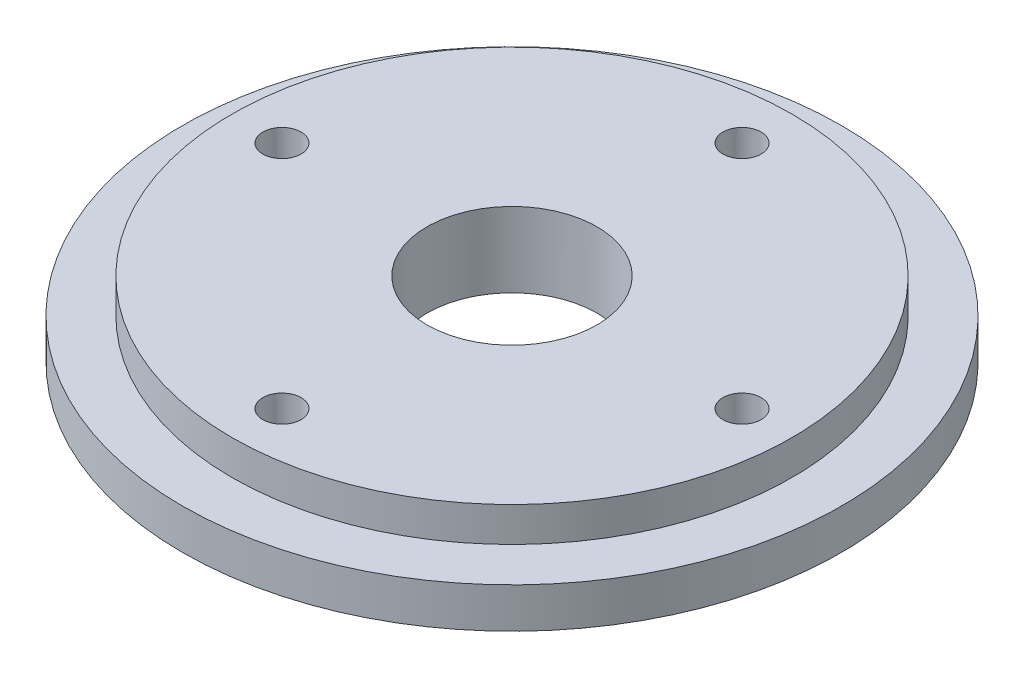
ISO-10303-21;
HEADER;
FILE_DESCRIPTION(('STEP AP214'),'2;1');
FILE_NAME('part.step','',(''),(''),'','','');
FILE_SCHEMA(('AUTOMOTIVE_DESIGN { 1 0 10303 214 1 1 1 1 }'));
ENDSEC;
DATA;
#1=APPLICATION_CONTEXT('core data for automotive mechanical design processes');
#2=APPLICATION_PROTOCOL_DEFINITION('international standard','automotive_design',2000,#1);
#3=PRODUCT_CONTEXT('',#1,'mechanical');
#4=PRODUCT('Part','Part','',(#3));
#5=PRODUCT_RELATED_PRODUCT_CATEGORY('part','',(#4));
#6=PRODUCT_DEFINITION_FORMATION('','',#4);
#7=PRODUCT_DEFINITION_CONTEXT('part definition',#1,'design');
#8=PRODUCT_DEFINITION('design','',#6,#7);
#9=PRODUCT_DEFINITION_SHAPE('','',#8);
#10=(LENGTH_UNIT() NAMED_UNIT(*) SI_UNIT(.MILLI.,.METRE.));
#11=(NAMED_UNIT(*) PLANE_ANGLE_UNIT() SI_UNIT($,.RADIAN.));
#12=(NAMED_UNIT(*) SI_UNIT($,.STERADIAN.) SOLID_ANGLE_UNIT());
#13=UNCERTAINTY_MEASURE_WITH_UNIT(LENGTH_MEASURE(1.E-05),#10,'distance_accuracy_value','');
#14=(GEOMETRIC_REPRESENTATION_CONTEXT(3) GLOBAL_UNCERTAINTY_ASSIGNED_CONTEXT((#13)) GLOBAL_UNIT_ASSIGNED_CONTEXT((#10,
#11,#12)) REPRESENTATION_CONTEXT('',''));
#15=CARTESIAN_POINT('',(0.,0.,0.));
#16=DIRECTION('',(0.,0.,1.));
#17=DIRECTION('',(1.,0.,0.));
#18=AXIS2_PLACEMENT_3D('',#15,#16,#17);
#19=CARTESIAN_POINT('',(0.,0.,0.));
#20=DIRECTION('',(0.,-1.,0.));
#21=DIRECTION('',(0.,0.,-1.));
#22=AXIS2_PLACEMENT_3D('',#19,#20,#21);
#23=PLANE('',#22);
#24=CARTESIAN_POINT('',(0.,0.,-34.9));
#25=DIRECTION('',(0.,-1.,0.));
#26=DIRECTION('',(0.,0.,-1.));
#27=AXIS2_PLACEMENT_3D('',#24,#25,#26);
#28=CIRCLE('',#27,2.9);
#29=CARTESIAN_POINT('',(0.,0.,-37.8));
#30=VERTEX_POINT('',#29);
#31=EDGE_CURVE('E68',#30,#30,#28,.F.);
#32=ORIENTED_EDGE('',*,*,#31,.T.);
#33=EDGE_LOOP('',(#32));
#34=FACE_BOUND('',#33,.T.);
#35=CARTESIAN_POINT('',(34.9,0.,0.));
#36=DIRECTION('',(0.,-1.,0.));
#37=DIRECTION('',(0.,0.,-1.));
#38=AXIS2_PLACEMENT_3D('',#35,#36,#37);
#39=CIRCLE('',#38,2.89999999999999);
#40=CARTESIAN_POINT('',(34.9,0.,-2.89999999999999));
#41=VERTEX_POINT('',#40);
#42=EDGE_CURVE('E61',#41,#41,#39,.F.);
#43=ORIENTED_EDGE('',*,*,#42,.T.);
#44=EDGE_LOOP('',(#43));
#45=FACE_BOUND('',#44,.T.);
#46=CARTESIAN_POINT('',(0.,0.,34.9));
#47=DIRECTION('',(0.,-1.,0.));
#48=DIRECTION('',(0.,0.,-1.));
#49=AXIS2_PLACEMENT_3D('',#46,#47,#48);
#50=CIRCLE('',#49,2.9);
#51=CARTESIAN_POINT('',(0.,0.,32.));
#52=VERTEX_POINT('',#51);
#53=EDGE_CURVE('E79',#52,#52,#50,.F.);
#54=ORIENTED_EDGE('',*,*,#53,.T.);
#55=EDGE_LOOP('',(#54));
#56=FACE_BOUND('',#55,.T.);
#57=CARTESIAN_POINT('',(-34.9,0.,0.));
#58=DIRECTION('',(0.,-1.,0.));
#59=DIRECTION('',(0.,0.,-1.));
#60=AXIS2_PLACEMENT_3D('',#57,#58,#59);
#61=CIRCLE('',#60,2.9);
#62=CARTESIAN_POINT('',(-34.9,0.,-2.9));
#63=VERTEX_POINT('',#62);
#64=EDGE_CURVE('E73',#63,#63,#61,.F.);
#65=ORIENTED_EDGE('',*,*,#64,.T.);
#66=EDGE_LOOP('',(#65));
#67=FACE_BOUND('',#66,.T.);
#68=CARTESIAN_POINT('',(0.,0.,0.));
#69=DIRECTION('',(0.,-1.,0.));
#70=DIRECTION('',(0.,0.,-1.));
#71=AXIS2_PLACEMENT_3D('',#68,#69,#70);
#72=CIRCLE('',#71,12.9);
#73=CARTESIAN_POINT('',(0.,0.,-12.9));
#74=VERTEX_POINT('',#73);
#75=EDGE_CURVE('E55',#74,#74,#72,.F.);
#76=ORIENTED_EDGE('',*,*,#75,.T.);
#77=EDGE_LOOP('',(#76));
#78=FACE_BOUND('',#77,.T.);
#79=CARTESIAN_POINT('',(0.,0.,0.));
#80=DIRECTION('',(0.,-1.,0.));
#81=DIRECTION('',(0.,0.,-1.));
#82=AXIS2_PLACEMENT_3D('',#79,#80,#81);
#83=CIRCLE('',#82,50.);
#84=CARTESIAN_POINT('',(0.,0.,-50.));
#85=VERTEX_POINT('',#84);
#86=EDGE_CURVE('E10',#85,#85,#83,.T.);
#87=ORIENTED_EDGE('',*,*,#86,.T.);
#88=EDGE_LOOP('',(#87));
#89=FACE_BOUND('',#88,.T.);
#90=ADVANCED_FACE('F35',(#34,#45,#56,#67,#78,#89),#23,.T.);
#91=CARTESIAN_POINT('',(0.,0.,0.));
#92=DIRECTION('',(0.,-1.,0.));
#93=DIRECTION('',(0.,0.,-1.));
#94=AXIS2_PLACEMENT_3D('',#91,#92,#93);
#95=CYLINDRICAL_SURFACE('',#94,50.);
#96=CARTESIAN_POINT('',(0.,6.1,0.));
#97=DIRECTION('',(0.,-1.,0.));
#98=DIRECTION('',(0.,0.,-1.));
#99=AXIS2_PLACEMENT_3D('',#96,#97,#98);
#100=CIRCLE('',#99,50.);
#101=CARTESIAN_POINT('',(0.,6.1,-50.));
#102=VERTEX_POINT('',#101);
#103=EDGE_CURVE('E41',#102,#102,#100,.T.);
#104=ORIENTED_EDGE('',*,*,#103,.T.);
#105=EDGE_LOOP('',(#104));
#106=FACE_BOUND('',#105,.T.);
#107=ORIENTED_EDGE('',*,*,#86,.F.);
#108=EDGE_LOOP('',(#107));
#109=FACE_BOUND('',#108,.T.);
#110=ADVANCED_FACE('F108',(#106,#109),#95,.T.);
#111=CARTESIAN_POINT('',(50.,6.1,0.));
#112=DIRECTION('',(0.,1.,0.));
#113=DIRECTION('',(0.,0.,1.));
#114=AXIS2_PLACEMENT_3D('',#111,#112,#113);
#115=PLANE('',#114);
#116=CARTESIAN_POINT('',(0.,6.1,0.));
#117=DIRECTION('',(0.,-1.,0.));
#118=DIRECTION('',(0.,0.,-1.));
#119=AXIS2_PLACEMENT_3D('',#116,#117,#118);
#120=CIRCLE('',#119,42.5);
#121=CARTESIAN_POINT('',(0.,6.1,-42.5));
#122=VERTEX_POINT('',#121);
#123=EDGE_CURVE('E45',#122,#122,#120,.T.);
#124=ORIENTED_EDGE('',*,*,#123,.T.);
#125=EDGE_LOOP('',(#124));
#126=FACE_BOUND('',#125,.T.);
#127=ORIENTED_EDGE('',*,*,#103,.F.);
#128=EDGE_LOOP('',(#127));
#129=FACE_BOUND('',#128,.T.);
#130=ADVANCED_FACE('F102',(#126,#129),#115,.T.);
#131=CARTESIAN_POINT('',(0.,0.,0.));
#132=DIRECTION('',(0.,-1.,0.));
#133=DIRECTION('',(0.,0.,-1.));
#134=AXIS2_PLACEMENT_3D('',#131,#132,#133);
#135=CYLINDRICAL_SURFACE('',#134,42.5);
#136=CARTESIAN_POINT('',(0.,11.35,0.));
#137=DIRECTION('',(0.,-1.,0.));
#138=DIRECTION('',(0.,0.,-1.));
#139=AXIS2_PLACEMENT_3D('',#136,#137,#138);
#140=CIRCLE('',#139,42.5);
#141=CARTESIAN_POINT('',(0.,11.35,-42.5));
#142=VERTEX_POINT('',#141);
#143=EDGE_CURVE('E49',#142,#142,#140,.T.);
#144=ORIENTED_EDGE('',*,*,#143,.T.);
#145=EDGE_LOOP('',(#144));
#146=FACE_BOUND('',#145,.T.);
#147=ORIENTED_EDGE('',*,*,#123,.F.);
#148=EDGE_LOOP('',(#147));
#149=FACE_BOUND('',#148,.T.);
#150=ADVANCED_FACE('F91',(#146,#149),#135,.T.);
#151=CARTESIAN_POINT('',(42.5,11.35,0.));
#152=DIRECTION('',(0.,1.,0.));
#153=DIRECTION('',(0.,0.,1.));
#154=AXIS2_PLACEMENT_3D('',#151,#152,#153);
#155=PLANE('',#154);
#156=CARTESIAN_POINT('',(0.,11.35,-34.9));
#157=DIRECTION('',(0.,1.,0.));
#158=DIRECTION('',(0.,0.,1.));
#159=AXIS2_PLACEMENT_3D('',#156,#157,#158);
#160=CIRCLE('',#159,2.9);
#161=CARTESIAN_POINT('',(0.,11.35,-32.));
#162=VERTEX_POINT('',#161);
#163=EDGE_CURVE('E58',#162,#162,#160,.T.);
#164=ORIENTED_EDGE('',*,*,#163,.F.);
#165=EDGE_LOOP('',(#164));
#166=FACE_BOUND('',#165,.T.);
#167=CARTESIAN_POINT('',(34.9,11.35,0.));
#168=DIRECTION('',(0.,1.,0.));
#169=DIRECTION('',(0.,0.,1.));
#170=AXIS2_PLACEMENT_3D('',#167,#168,#169);
#171=CIRCLE('',#170,2.89999999999999);
#172=CARTESIAN_POINT('',(34.9,11.35,2.89999999999999));
#173=VERTEX_POINT('',#172);
#174=EDGE_CURVE('E64',#173,#173,#171,.T.);
#175=ORIENTED_EDGE('',*,*,#174,.F.);
#176=EDGE_LOOP('',(#175));
#177=FACE_BOUND('',#176,.T.);
#178=CARTESIAN_POINT('',(0.,11.35,34.9));
#179=DIRECTION('',(0.,1.,0.));
#180=DIRECTION('',(0.,0.,1.));
#181=AXIS2_PLACEMENT_3D('',#178,#179,#180);
#182=CIRCLE('',#181,2.9);
#183=CARTESIAN_POINT('',(0.,11.35,37.8));
#184=VERTEX_POINT('',#183);
#185=EDGE_CURVE('E65',#184,#184,#182,.T.);
#186=ORIENTED_EDGE('',*,*,#185,.F.);
#187=EDGE_LOOP('',(#186));
#188=FACE_BOUND('',#187,.T.);
#189=CARTESIAN_POINT('',(-34.9,11.35,0.));
#190=DIRECTION('',(0.,1.,0.));
#191=DIRECTION('',(0.,0.,1.));
#192=AXIS2_PLACEMENT_3D('',#189,#190,#191);
#193=CIRCLE('',#192,2.9);
#194=CARTESIAN_POINT('',(-34.9,11.35,2.9));
#195=VERTEX_POINT('',#194);
#196=EDGE_CURVE('E76',#195,#195,#193,.T.);
#197=ORIENTED_EDGE('',*,*,#196,.F.);
#198=EDGE_LOOP('',(#197));
#199=FACE_BOUND('',#198,.T.);
#200=CARTESIAN_POINT('',(0.,11.35,0.));
#201=DIRECTION('',(0.,1.,0.));
#202=DIRECTION('',(0.,0.,1.));
#203=AXIS2_PLACEMENT_3D('',#200,#201,#202);
#204=CIRCLE('',#203,12.9);
#205=CARTESIAN_POINT('',(0.,11.35,12.9));
#206=VERTEX_POINT('',#205);
#207=EDGE_CURVE('E54',#206,#206,#204,.T.);
#208=ORIENTED_EDGE('',*,*,#207,.F.);
#209=EDGE_LOOP('',(#208));
#210=FACE_BOUND('',#209,.T.);
#211=ORIENTED_EDGE('',*,*,#143,.F.);
#212=EDGE_LOOP('',(#211));
#213=FACE_BOUND('',#212,.T.);
#214=ADVANCED_FACE('F87',(#166,#177,#188,#199,#210,#213),#155,.T.);
#215=CARTESIAN_POINT('',(0.,-0.000999999999999265,0.));
#216=DIRECTION('',(0.,1.,0.));
#217=DIRECTION('',(0.,0.,1.));
#218=AXIS2_PLACEMENT_3D('',#215,#216,#217);
#219=CYLINDRICAL_SURFACE('',#218,12.9);
#220=ORIENTED_EDGE('',*,*,#75,.F.);
#221=EDGE_LOOP('',(#220));
#222=FACE_BOUND('',#221,.T.);
#223=ORIENTED_EDGE('',*,*,#207,.T.);
#224=EDGE_LOOP('',(#223));
#225=FACE_BOUND('',#224,.T.);
#226=ADVANCED_FACE('F90',(#222,#225),#219,.F.);
#227=CARTESIAN_POINT('',(-34.9,-0.000999999999999265,0.));
#228=DIRECTION('',(0.,1.,0.));
#229=DIRECTION('',(0.,0.,1.));
#230=AXIS2_PLACEMENT_3D('',#227,#228,#229);
#231=CYLINDRICAL_SURFACE('',#230,2.9);
#232=ORIENTED_EDGE('',*,*,#64,.F.);
#233=EDGE_LOOP('',(#232));
#234=FACE_BOUND('',#233,.T.);
#235=ORIENTED_EDGE('',*,*,#196,.T.);
#236=EDGE_LOOP('',(#235));
#237=FACE_BOUND('',#236,.T.);
#238=ADVANCED_FACE('F129',(#234,#237),#231,.F.);
#239=CARTESIAN_POINT('',(0.,-0.000999999999999265,34.9));
#240=DIRECTION('',(0.,1.,0.));
#241=DIRECTION('',(0.,0.,1.));
#242=AXIS2_PLACEMENT_3D('',#239,#240,#241);
#243=CYLINDRICAL_SURFACE('',#242,2.9);
#244=ORIENTED_EDGE('',*,*,#53,.F.);
#245=EDGE_LOOP('',(#244));
#246=FACE_BOUND('',#245,.T.);
#247=ORIENTED_EDGE('',*,*,#185,.T.);
#248=EDGE_LOOP('',(#247));
#249=FACE_BOUND('',#248,.T.);
#250=ADVANCED_FACE('F85',(#246,#249),#243,.F.);
#251=CARTESIAN_POINT('',(34.9,-0.000999999999999265,0.));
#252=DIRECTION('',(0.,1.,0.));
#253=DIRECTION('',(0.,0.,1.));
#254=AXIS2_PLACEMENT_3D('',#251,#252,#253);
#255=CYLINDRICAL_SURFACE('',#254,2.89999999999999);
#256=ORIENTED_EDGE('',*,*,#42,.F.);
#257=EDGE_LOOP('',(#256));
#258=FACE_BOUND('',#257,.T.);
#259=ORIENTED_EDGE('',*,*,#174,.T.);
#260=EDGE_LOOP('',(#259));
#261=FACE_BOUND('',#260,.T.);
#262=ADVANCED_FACE('F137',(#258,#261),#255,.F.);
#263=CARTESIAN_POINT('',(0.,-0.000999999999999265,-34.9));
#264=DIRECTION('',(0.,1.,0.));
#265=DIRECTION('',(0.,0.,1.));
#266=AXIS2_PLACEMENT_3D('',#263,#264,#265);
#267=CYLINDRICAL_SURFACE('',#266,2.9);
#268=ORIENTED_EDGE('',*,*,#31,.F.);
#269=EDGE_LOOP('',(#268));
#270=FACE_BOUND('',#269,.T.);
#271=ORIENTED_EDGE('',*,*,#163,.T.);
#272=EDGE_LOOP('',(#271));
#273=FACE_BOUND('',#272,.T.);
#274=ADVANCED_FACE('F140',(#270,#273),#267,.F.);
#275=CLOSED_SHELL('',(#90,#110,#130,#150,#214,#226,#238,#250,#262,#274));
#276=MANIFOLD_SOLID_BREP('B2',#275);
#277=ADVANCED_BREP_SHAPE_REPRESENTATION('',(#18,#276),#14);
#278=SHAPE_DEFINITION_REPRESENTATION(#9,#277);
ENDSEC;
END-ISO-10303-21;
